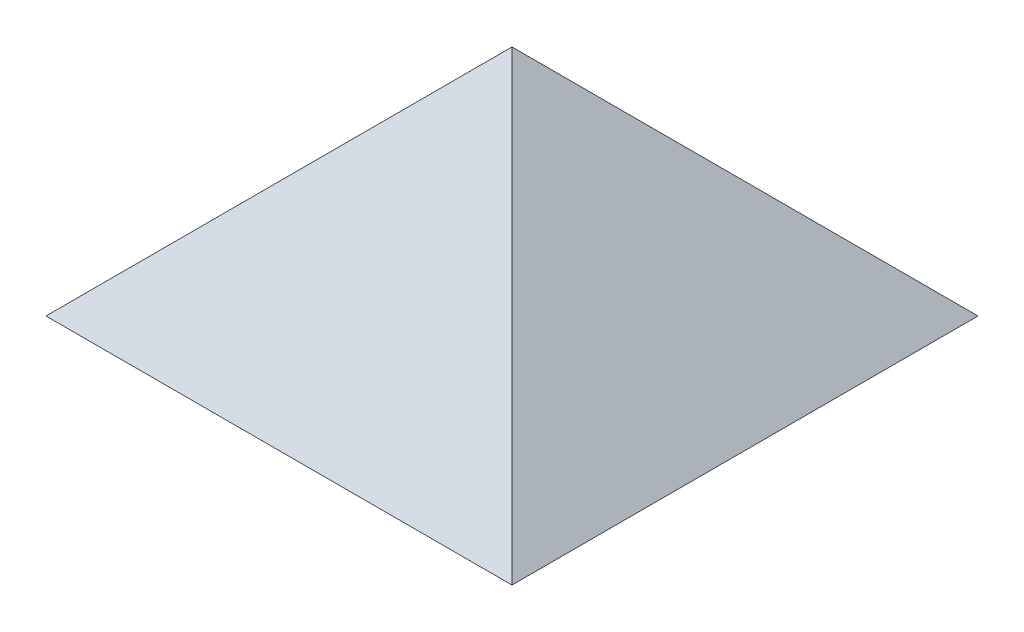
ISO-10303-21;
HEADER;
FILE_DESCRIPTION(('STEP AP214'),'2;1');
FILE_NAME('part.step','',(''),(''),'','','');
FILE_SCHEMA(('AUTOMOTIVE_DESIGN { 1 0 10303 214 1 1 1 1 }'));
ENDSEC;
DATA;
#1=APPLICATION_CONTEXT('core data for automotive mechanical design processes');
#2=APPLICATION_PROTOCOL_DEFINITION('international standard','automotive_design',2000,#1);
#3=PRODUCT_CONTEXT('',#1,'mechanical');
#4=PRODUCT('Part','Part','',(#3));
#5=PRODUCT_RELATED_PRODUCT_CATEGORY('part','',(#4));
#6=PRODUCT_DEFINITION_FORMATION('','',#4);
#7=PRODUCT_DEFINITION_CONTEXT('part definition',#1,'design');
#8=PRODUCT_DEFINITION('design','',#6,#7);
#9=PRODUCT_DEFINITION_SHAPE('','',#8);
#10=(LENGTH_UNIT() NAMED_UNIT(*) SI_UNIT(.MILLI.,.METRE.));
#11=(NAMED_UNIT(*) PLANE_ANGLE_UNIT() SI_UNIT($,.RADIAN.));
#12=(NAMED_UNIT(*) SI_UNIT($,.STERADIAN.) SOLID_ANGLE_UNIT());
#13=UNCERTAINTY_MEASURE_WITH_UNIT(LENGTH_MEASURE(1.E-05),#10,'distance_accuracy_value','');
#14=(GEOMETRIC_REPRESENTATION_CONTEXT(3) GLOBAL_UNCERTAINTY_ASSIGNED_CONTEXT((#13)) GLOBAL_UNIT_ASSIGNED_CONTEXT((#10,
#11,#12)) REPRESENTATION_CONTEXT('',''));
#15=CARTESIAN_POINT('',(0.,0.,0.));
#16=DIRECTION('',(0.,0.,1.));
#17=DIRECTION('',(1.,0.,0.));
#18=AXIS2_PLACEMENT_3D('',#15,#16,#17);
#19=CARTESIAN_POINT('',(25.,0.,25.));
#20=DIRECTION('',(0.707106781186546,0.707106781186549,0.));
#21=DIRECTION('',(-0.707106781186549,0.707106781186546,0.));
#22=AXIS2_PLACEMENT_3D('',#19,#20,#21);
#23=PLANE('',#22);
#24=DIRECTION('',(0.,0.,-1.));
#25=VECTOR('',#24,1.);
#26=CARTESIAN_POINT('',(25.,0.,25.));
#27=LINE('',#26,#25);
#28=CARTESIAN_POINT('',(25.,0.,25.));
#29=VERTEX_POINT('',#28);
#30=CARTESIAN_POINT('',(25.,0.,-25.));
#31=VERTEX_POINT('',#30);
#32=EDGE_CURVE('E82',#29,#31,#27,.T.);
#33=ORIENTED_EDGE('',*,*,#32,.T.);
#34=DIRECTION('',(0.577350269189627,-0.577350269189624,-0.577350269189627));
#35=VECTOR('',#34,1.);
#36=CARTESIAN_POINT('',(8.3333333333333,16.6666666666667,-8.33333333333329));
#37=LINE('',#36,#35);
#38=CARTESIAN_POINT('',(0.,24.9999999999999,0.));
#39=VERTEX_POINT('',#38);
#40=EDGE_CURVE('E11',#39,#31,#37,.T.);
#41=ORIENTED_EDGE('',*,*,#40,.F.);
#42=DIRECTION('',(0.577350269189627,-0.577350269189624,0.577350269189627));
#43=VECTOR('',#42,1.);
#44=CARTESIAN_POINT('',(25.,0.,25.));
#45=LINE('',#44,#43);
#46=EDGE_CURVE('E67',#39,#29,#45,.T.);
#47=ORIENTED_EDGE('',*,*,#46,.T.);
#48=EDGE_LOOP('',(#33,#41,#47));
#49=FACE_BOUND('',#48,.T.);
#50=ADVANCED_FACE('F44',(#49),#23,.T.);
#51=CARTESIAN_POINT('',(-25.,0.,-25.));
#52=DIRECTION('',(0.,0.707106781186549,-0.707106781186546));
#53=DIRECTION('',(0.,0.707106781186546,0.707106781186549));
#54=AXIS2_PLACEMENT_3D('',#51,#52,#53);
#55=PLANE('',#54);
#56=DIRECTION('',(-1.,0.,0.));
#57=VECTOR('',#56,1.);
#58=CARTESIAN_POINT('',(-25.,0.,-25.));
#59=LINE('',#58,#57);
#60=CARTESIAN_POINT('',(-25.,0.,-25.));
#61=VERTEX_POINT('',#60);
#62=EDGE_CURVE('E79',#31,#61,#59,.T.);
#63=ORIENTED_EDGE('',*,*,#62,.T.);
#64=DIRECTION('',(-0.577350269189627,-0.577350269189624,-0.577350269189627));
#65=VECTOR('',#64,1.);
#66=CARTESIAN_POINT('',(-8.33333333333329,16.6666666666667,-8.3333333333333));
#67=LINE('',#66,#65);
#68=EDGE_CURVE('E48',#39,#61,#67,.T.);
#69=ORIENTED_EDGE('',*,*,#68,.F.);
#70=ORIENTED_EDGE('',*,*,#40,.T.);
#71=EDGE_LOOP('',(#63,#69,#70));
#72=FACE_BOUND('',#71,.T.);
#73=ADVANCED_FACE('F46',(#72),#55,.T.);
#74=CARTESIAN_POINT('',(-25.,0.,25.));
#75=DIRECTION('',(-0.707106781186546,0.707106781186549,0.));
#76=DIRECTION('',(-0.707106781186549,-0.707106781186546,0.));
#77=AXIS2_PLACEMENT_3D('',#74,#75,#76);
#78=PLANE('',#77);
#79=DIRECTION('',(0.,0.,1.));
#80=VECTOR('',#79,1.);
#81=CARTESIAN_POINT('',(-25.,0.,25.));
#82=LINE('',#81,#80);
#83=CARTESIAN_POINT('',(-25.,0.,25.));
#84=VERTEX_POINT('',#83);
#85=EDGE_CURVE('E84',#61,#84,#82,.T.);
#86=ORIENTED_EDGE('',*,*,#85,.T.);
#87=DIRECTION('',(-0.577350269189627,-0.577350269189624,0.577350269189627));
#88=VECTOR('',#87,1.);
#89=CARTESIAN_POINT('',(-25.,0.,25.));
#90=LINE('',#89,#88);
#91=EDGE_CURVE('E96',#39,#84,#90,.T.);
#92=ORIENTED_EDGE('',*,*,#91,.F.);
#93=ORIENTED_EDGE('',*,*,#68,.T.);
#94=EDGE_LOOP('',(#86,#92,#93));
#95=FACE_BOUND('',#94,.T.);
#96=ADVANCED_FACE('F101',(#95),#78,.T.);
#97=CARTESIAN_POINT('',(-25.,0.,25.));
#98=DIRECTION('',(0.,0.707106781186549,0.707106781186546));
#99=DIRECTION('',(0.,-0.707106781186546,0.707106781186549));
#100=AXIS2_PLACEMENT_3D('',#97,#98,#99);
#101=PLANE('',#100);
#102=DIRECTION('',(1.,0.,0.));
#103=VECTOR('',#102,1.);
#104=CARTESIAN_POINT('',(-25.,0.,25.));
#105=LINE('',#104,#103);
#106=EDGE_CURVE('E92',#84,#29,#105,.T.);
#107=ORIENTED_EDGE('',*,*,#106,.T.);
#108=ORIENTED_EDGE('',*,*,#46,.F.);
#109=ORIENTED_EDGE('',*,*,#91,.T.);
#110=EDGE_LOOP('',(#107,#108,#109));
#111=FACE_BOUND('',#110,.T.);
#112=ADVANCED_FACE('F102',(#111),#101,.T.);
#113=CARTESIAN_POINT('',(0.,0.,0.));
#114=DIRECTION('',(0.,-1.,0.));
#115=DIRECTION('',(0.,0.,-1.));
#116=AXIS2_PLACEMENT_3D('',#113,#114,#115);
#117=PLANE('',#116);
#118=ORIENTED_EDGE('',*,*,#32,.F.);
#119=ORIENTED_EDGE('',*,*,#106,.F.);
#120=ORIENTED_EDGE('',*,*,#85,.F.);
#121=ORIENTED_EDGE('',*,*,#62,.F.);
#122=EDGE_LOOP('',(#118,#119,#120,#121));
#123=FACE_BOUND('',#122,.T.);
#124=ADVANCED_FACE('F80',(#123),#117,.T.);
#125=CLOSED_SHELL('',(#50,#73,#96,#112,#124));
#126=MANIFOLD_SOLID_BREP('B2',#125);
#127=ADVANCED_BREP_SHAPE_REPRESENTATION('',(#18,#126),#14);
#128=SHAPE_DEFINITION_REPRESENTATION(#9,#127);
ENDSEC;
END-ISO-10303-21;
